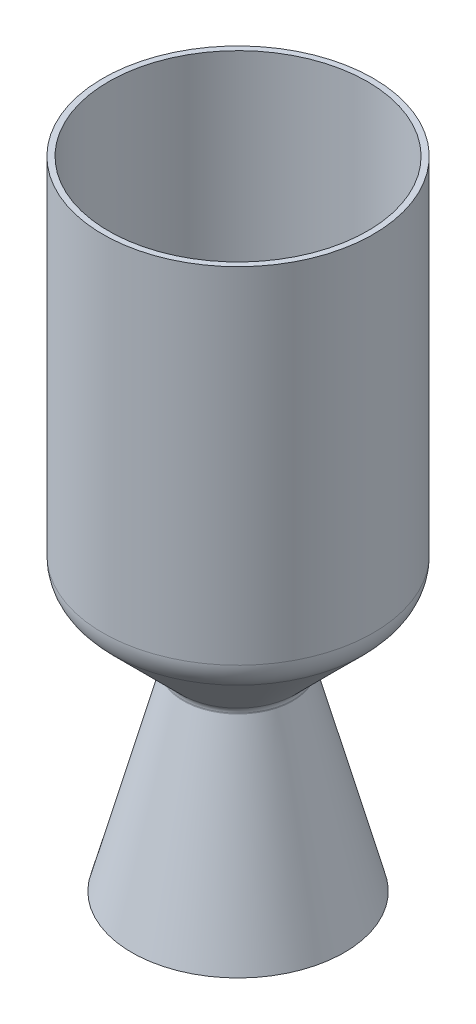
ISO-10303-21;
HEADER;
FILE_DESCRIPTION(('STEP AP214'),'2;1');
FILE_NAME('part.step','',(''),(''),'','','');
FILE_SCHEMA(('AUTOMOTIVE_DESIGN { 1 0 10303 214 1 1 1 1 }'));
ENDSEC;
DATA;
#1=APPLICATION_CONTEXT('core data for automotive mechanical design processes');
#2=APPLICATION_PROTOCOL_DEFINITION('international standard','automotive_design',2000,#1);
#3=PRODUCT_CONTEXT('',#1,'mechanical');
#4=PRODUCT('Part','Part','',(#3));
#5=PRODUCT_RELATED_PRODUCT_CATEGORY('part','',(#4));
#6=PRODUCT_DEFINITION_FORMATION('','',#4);
#7=PRODUCT_DEFINITION_CONTEXT('part definition',#1,'design');
#8=PRODUCT_DEFINITION('design','',#6,#7);
#9=PRODUCT_DEFINITION_SHAPE('','',#8);
#10=(LENGTH_UNIT() NAMED_UNIT(*) SI_UNIT(.MILLI.,.METRE.));
#11=(NAMED_UNIT(*) PLANE_ANGLE_UNIT() SI_UNIT($,.RADIAN.));
#12=(NAMED_UNIT(*) SI_UNIT($,.STERADIAN.) SOLID_ANGLE_UNIT());
#13=UNCERTAINTY_MEASURE_WITH_UNIT(LENGTH_MEASURE(1.E-05),#10,'distance_accuracy_value','');
#14=(GEOMETRIC_REPRESENTATION_CONTEXT(3) GLOBAL_UNCERTAINTY_ASSIGNED_CONTEXT((#13)) GLOBAL_UNIT_ASSIGNED_CONTEXT((#10,
#11,#12)) REPRESENTATION_CONTEXT('',''));
#15=CARTESIAN_POINT('',(0.,0.,0.));
#16=DIRECTION('',(0.,0.,1.));
#17=DIRECTION('',(1.,0.,0.));
#18=AXIS2_PLACEMENT_3D('',#15,#16,#17);
#19=CARTESIAN_POINT('',(0.,-0.328700187280291,0.));
#20=DIRECTION('',(0.,-1.,0.));
#21=DIRECTION('',(0.,0.,-1.));
#22=AXIS2_PLACEMENT_3D('',#19,#20,#21);
#23=CONICAL_SURFACE('',#22,24.1732742006129,0.261799387799116);
#24=CARTESIAN_POINT('',(0.,-85.1588771022838,0.));
#25=DIRECTION('',(0.,-1.,0.));
#26=DIRECTION('',(0.,0.,-1.));
#27=AXIS2_PLACEMENT_3D('',#24,#25,#26);
#28=CIRCLE('',#27,46.9034515987742);
#29=CARTESIAN_POINT('',(0.,-85.1588771022838,-46.9034515987742));
#30=VERTEX_POINT('',#29);
#31=EDGE_CURVE('E98',#30,#30,#28,.T.);
#32=ORIENTED_EDGE('',*,*,#31,.F.);
#33=EDGE_LOOP('',(#32));
#34=FACE_BOUND('',#33,.T.);
#35=CARTESIAN_POINT('',(0.,-0.328700187280291,0.));
#36=DIRECTION('',(0.,-1.,0.));
#37=DIRECTION('',(0.,0.,-1.));
#38=AXIS2_PLACEMENT_3D('',#35,#36,#37);
#39=CIRCLE('',#38,24.1732742006129);
#40=CARTESIAN_POINT('',(0.,-0.328700187280291,-24.1732742006129));
#41=VERTEX_POINT('',#40);
#42=EDGE_CURVE('E10',#41,#41,#39,.T.);
#43=ORIENTED_EDGE('',*,*,#42,.T.);
#44=EDGE_LOOP('',(#43));
#45=FACE_BOUND('',#44,.T.);
#46=ADVANCED_FACE('F39',(#34,#45),#23,.T.);
#47=CARTESIAN_POINT('',(0.,-1.30614446586829E-13,0.));
#48=DIRECTION('',(0.,-1.,0.));
#49=DIRECTION('',(0.,0.,-1.));
#50=AXIS2_PLACEMENT_3D('',#47,#48,#49);
#51=TOROIDAL_SURFACE('',#50,25.4,1.27);
#52=ORIENTED_EDGE('',*,*,#42,.F.);
#53=EDGE_LOOP('',(#52));
#54=FACE_BOUND('',#53,.T.);
#55=CARTESIAN_POINT('',(0.,0.,0.));
#56=DIRECTION('',(0.,-1.,0.));
#57=DIRECTION('',(0.,0.,-1.));
#58=AXIS2_PLACEMENT_3D('',#55,#56,#57);
#59=CIRCLE('',#58,24.13);
#60=CARTESIAN_POINT('',(0.,0.,-24.13));
#61=VERTEX_POINT('',#60);
#62=EDGE_CURVE('E46',#61,#61,#59,.T.);
#63=ORIENTED_EDGE('',*,*,#62,.T.);
#64=EDGE_LOOP('',(#63));
#65=FACE_BOUND('',#64,.T.);
#66=ADVANCED_FACE('F107',(#54,#65),#51,.F.);
#67=CARTESIAN_POINT('',(0.,-2.17690744311381E-13,0.));
#68=DIRECTION('',(0.,-1.,0.));
#69=DIRECTION('',(0.,0.,-1.));
#70=AXIS2_PLACEMENT_3D('',#67,#68,#69);
#71=TOROIDAL_SURFACE('',#70,27.94,3.81);
#72=ORIENTED_EDGE('',*,*,#62,.F.);
#73=EDGE_LOOP('',(#72));
#74=FACE_BOUND('',#73,.T.);
#75=CARTESIAN_POINT('',(0.,2.69407683632053,0.));
#76=DIRECTION('',(0.,-1.,0.));
#77=DIRECTION('',(0.,0.,-1.));
#78=AXIS2_PLACEMENT_3D('',#75,#76,#77);
#79=CIRCLE('',#78,25.2459231636792);
#80=CARTESIAN_POINT('',(0.,2.69407683632053,-25.2459231636792));
#81=VERTEX_POINT('',#80);
#82=EDGE_CURVE('E51',#81,#81,#79,.T.);
#83=ORIENTED_EDGE('',*,*,#82,.T.);
#84=EDGE_LOOP('',(#83));
#85=FACE_BOUND('',#84,.T.);
#86=ADVANCED_FACE('F111',(#74,#85),#71,.F.);
#87=CARTESIAN_POINT('',(0.,32.6744610179241,0.));
#88=DIRECTION('',(0.,1.,0.));
#89=DIRECTION('',(0.,0.,1.));
#90=AXIS2_PLACEMENT_3D('',#87,#88,#89);
#91=CONICAL_SURFACE('',#90,55.2263073452829,0.785398163397451);
#92=ORIENTED_EDGE('',*,*,#82,.F.);
#93=EDGE_LOOP('',(#92));
#94=FACE_BOUND('',#93,.T.);
#95=CARTESIAN_POINT('',(0.,32.6744610179241,0.));
#96=DIRECTION('',(0.,-1.,0.));
#97=DIRECTION('',(0.,0.,-1.));
#98=AXIS2_PLACEMENT_3D('',#95,#96,#97);
#99=CIRCLE('',#98,55.2263073452829);
#100=CARTESIAN_POINT('',(0.,32.6744610179241,-55.2263073452829));
#101=VERTEX_POINT('',#100);
#102=EDGE_CURVE('E56',#101,#101,#99,.T.);
#103=ORIENTED_EDGE('',*,*,#102,.T.);
#104=EDGE_LOOP('',(#103));
#105=FACE_BOUND('',#104,.T.);
#106=ADVANCED_FACE('F116',(#94,#105),#91,.T.);
#107=CARTESIAN_POINT('',(0.,43.4507683632071,0.));
#108=DIRECTION('',(0.,-1.,0.));
#109=DIRECTION('',(0.,0.,-1.));
#110=AXIS2_PLACEMENT_3D('',#107,#108,#109);
#111=TOROIDAL_SURFACE('',#110,44.45,15.24);
#112=ORIENTED_EDGE('',*,*,#102,.F.);
#113=EDGE_LOOP('',(#112));
#114=FACE_BOUND('',#113,.T.);
#115=CARTESIAN_POINT('',(0.,43.4507683632071,0.));
#116=DIRECTION('',(0.,-1.,0.));
#117=DIRECTION('',(0.,0.,-1.));
#118=AXIS2_PLACEMENT_3D('',#115,#116,#117);
#119=CIRCLE('',#118,59.69);
#120=CARTESIAN_POINT('',(0.,43.4507683632071,-59.69));
#121=VERTEX_POINT('',#120);
#122=EDGE_CURVE('E62',#121,#121,#119,.T.);
#123=ORIENTED_EDGE('',*,*,#122,.T.);
#124=EDGE_LOOP('',(#123));
#125=FACE_BOUND('',#124,.T.);
#126=ADVANCED_FACE('F122',(#114,#125),#111,.T.);
#127=CARTESIAN_POINT('',(0.,0.,0.));
#128=DIRECTION('',(0.,-1.,0.));
#129=DIRECTION('',(0.,0.,-1.));
#130=AXIS2_PLACEMENT_3D('',#127,#128,#129);
#131=CYLINDRICAL_SURFACE('',#130,59.69);
#132=ORIENTED_EDGE('',*,*,#122,.F.);
#133=EDGE_LOOP('',(#132));
#134=FACE_BOUND('',#133,.T.);
#135=CARTESIAN_POINT('',(0.,195.850768363207,0.));
#136=DIRECTION('',(0.,-1.,0.));
#137=DIRECTION('',(0.,0.,-1.));
#138=AXIS2_PLACEMENT_3D('',#135,#136,#137);
#139=CIRCLE('',#138,59.69);
#140=CARTESIAN_POINT('',(0.,195.850768363207,-59.69));
#141=VERTEX_POINT('',#140);
#142=EDGE_CURVE('E66',#141,#141,#139,.T.);
#143=ORIENTED_EDGE('',*,*,#142,.T.);
#144=EDGE_LOOP('',(#143));
#145=FACE_BOUND('',#144,.T.);
#146=ADVANCED_FACE('F126',(#134,#145),#131,.T.);
#147=CARTESIAN_POINT('',(-59.69,195.850768363207,0.));
#148=DIRECTION('',(0.,1.,0.));
#149=DIRECTION('',(0.,0.,1.));
#150=AXIS2_PLACEMENT_3D('',#147,#148,#149);
#151=PLANE('',#150);
#152=CARTESIAN_POINT('',(0.,195.850768363207,0.));
#153=DIRECTION('',(0.,-1.,0.));
#154=DIRECTION('',(0.,0.,-1.));
#155=AXIS2_PLACEMENT_3D('',#152,#153,#154);
#156=CIRCLE('',#155,57.15);
#157=CARTESIAN_POINT('',(0.,195.850768363207,-57.15));
#158=VERTEX_POINT('',#157);
#159=EDGE_CURVE('E70',#158,#158,#156,.T.);
#160=ORIENTED_EDGE('',*,*,#159,.T.);
#161=EDGE_LOOP('',(#160));
#162=FACE_BOUND('',#161,.T.);
#163=ORIENTED_EDGE('',*,*,#142,.F.);
#164=EDGE_LOOP('',(#163));
#165=FACE_BOUND('',#164,.T.);
#166=ADVANCED_FACE('F130',(#162,#165),#151,.T.);
#167=CARTESIAN_POINT('',(0.,0.,0.));
#168=DIRECTION('',(0.,-1.,0.));
#169=DIRECTION('',(0.,0.,-1.));
#170=AXIS2_PLACEMENT_3D('',#167,#168,#169);
#171=CYLINDRICAL_SURFACE('',#170,57.15);
#172=CARTESIAN_POINT('',(0.,43.4507683632071,0.));
#173=DIRECTION('',(0.,-1.,0.));
#174=DIRECTION('',(0.,0.,-1.));
#175=AXIS2_PLACEMENT_3D('',#172,#173,#174);
#176=CIRCLE('',#175,57.15);
#177=CARTESIAN_POINT('',(0.,43.4507683632071,-57.15));
#178=VERTEX_POINT('',#177);
#179=EDGE_CURVE('E74',#178,#178,#176,.T.);
#180=ORIENTED_EDGE('',*,*,#179,.T.);
#181=EDGE_LOOP('',(#180));
#182=FACE_BOUND('',#181,.T.);
#183=ORIENTED_EDGE('',*,*,#159,.F.);
#184=EDGE_LOOP('',(#183));
#185=FACE_BOUND('',#184,.T.);
#186=ADVANCED_FACE('F134',(#182,#185),#171,.F.);
#187=CARTESIAN_POINT('',(0.,43.4507683632071,0.));
#188=DIRECTION('',(0.,-1.,0.));
#189=DIRECTION('',(0.,0.,-1.));
#190=AXIS2_PLACEMENT_3D('',#187,#188,#189);
#191=TOROIDAL_SURFACE('',#190,44.45,12.7);
#192=CARTESIAN_POINT('',(0.,34.4705122421379,0.));
#193=DIRECTION('',(0.,-1.,0.));
#194=DIRECTION('',(0.,0.,-1.));
#195=AXIS2_PLACEMENT_3D('',#192,#193,#194);
#196=CIRCLE('',#195,53.4302561210691);
#197=CARTESIAN_POINT('',(0.,34.4705122421379,-53.4302561210691));
#198=VERTEX_POINT('',#197);
#199=EDGE_CURVE('E78',#198,#198,#196,.T.);
#200=ORIENTED_EDGE('',*,*,#199,.T.);
#201=EDGE_LOOP('',(#200));
#202=FACE_BOUND('',#201,.T.);
#203=ORIENTED_EDGE('',*,*,#179,.F.);
#204=EDGE_LOOP('',(#203));
#205=FACE_BOUND('',#204,.T.);
#206=ADVANCED_FACE('F138',(#202,#205),#191,.F.);
#207=CARTESIAN_POINT('',(0.,34.4705122421379,0.));
#208=DIRECTION('',(0.,1.,0.));
#209=DIRECTION('',(0.,0.,1.));
#210=AXIS2_PLACEMENT_3D('',#207,#208,#209);
#211=CONICAL_SURFACE('',#210,53.4302561210691,0.78539816339745);
#212=CARTESIAN_POINT('',(0.,4.49012806053436,0.));
#213=DIRECTION('',(0.,-1.,0.));
#214=DIRECTION('',(0.,0.,-1.));
#215=AXIS2_PLACEMENT_3D('',#212,#213,#214);
#216=CIRCLE('',#215,23.4498719394654);
#217=CARTESIAN_POINT('',(0.,4.49012806053436,-23.4498719394654));
#218=VERTEX_POINT('',#217);
#219=EDGE_CURVE('E82',#218,#218,#216,.T.);
#220=ORIENTED_EDGE('',*,*,#219,.T.);
#221=EDGE_LOOP('',(#220));
#222=FACE_BOUND('',#221,.T.);
#223=ORIENTED_EDGE('',*,*,#199,.F.);
#224=EDGE_LOOP('',(#223));
#225=FACE_BOUND('',#224,.T.);
#226=ADVANCED_FACE('F142',(#222,#225),#211,.F.);
#227=CARTESIAN_POINT('',(0.,-2.17690744311381E-13,0.));
#228=DIRECTION('',(0.,-1.,0.));
#229=DIRECTION('',(0.,0.,-1.));
#230=AXIS2_PLACEMENT_3D('',#227,#228,#229);
#231=TOROIDAL_SURFACE('',#230,27.94,6.35);
#232=CARTESIAN_POINT('',(0.,0.,0.));
#233=DIRECTION('',(0.,-1.,0.));
#234=DIRECTION('',(0.,0.,-1.));
#235=AXIS2_PLACEMENT_3D('',#232,#233,#234);
#236=CIRCLE('',#235,21.59);
#237=CARTESIAN_POINT('',(0.,0.,-21.59));
#238=VERTEX_POINT('',#237);
#239=EDGE_CURVE('E86',#238,#238,#236,.T.);
#240=ORIENTED_EDGE('',*,*,#239,.T.);
#241=EDGE_LOOP('',(#240));
#242=FACE_BOUND('',#241,.T.);
#243=ORIENTED_EDGE('',*,*,#219,.F.);
#244=EDGE_LOOP('',(#243));
#245=FACE_BOUND('',#244,.T.);
#246=ADVANCED_FACE('F146',(#242,#245),#231,.T.);
#247=CARTESIAN_POINT('',(0.,-1.30614446586829E-13,0.));
#248=DIRECTION('',(0.,-1.,0.));
#249=DIRECTION('',(0.,0.,-1.));
#250=AXIS2_PLACEMENT_3D('',#247,#248,#249);
#251=TOROIDAL_SURFACE('',#250,25.4,3.81);
#252=CARTESIAN_POINT('',(0.,-0.98610056184061,0.));
#253=DIRECTION('',(0.,-1.,0.));
#254=DIRECTION('',(0.,0.,-1.));
#255=AXIS2_PLACEMENT_3D('',#252,#253,#254);
#256=CIRCLE('',#255,21.7198226018386);
#257=CARTESIAN_POINT('',(0.,-0.98610056184061,-21.7198226018386));
#258=VERTEX_POINT('',#257);
#259=EDGE_CURVE('E90',#258,#258,#256,.T.);
#260=ORIENTED_EDGE('',*,*,#259,.T.);
#261=EDGE_LOOP('',(#260));
#262=FACE_BOUND('',#261,.T.);
#263=ORIENTED_EDGE('',*,*,#239,.F.);
#264=EDGE_LOOP('',(#263));
#265=FACE_BOUND('',#264,.T.);
#266=ADVANCED_FACE('F150',(#262,#265),#251,.T.);
#267=CARTESIAN_POINT('',(0.,-0.98610056184061,0.));
#268=DIRECTION('',(0.,-1.,0.));
#269=DIRECTION('',(0.,0.,-1.));
#270=AXIS2_PLACEMENT_3D('',#267,#268,#269);
#271=CONICAL_SURFACE('',#270,21.7198226018386,0.261799387799116);
#272=CARTESIAN_POINT('',(0.,-85.8162774768441,0.));
#273=DIRECTION('',(0.,-1.,0.));
#274=DIRECTION('',(0.,0.,-1.));
#275=AXIS2_PLACEMENT_3D('',#272,#273,#274);
#276=CIRCLE('',#275,44.45);
#277=CARTESIAN_POINT('',(0.,-85.8162774768441,-44.45));
#278=VERTEX_POINT('',#277);
#279=EDGE_CURVE('E94',#278,#278,#276,.T.);
#280=ORIENTED_EDGE('',*,*,#279,.T.);
#281=EDGE_LOOP('',(#280));
#282=FACE_BOUND('',#281,.T.);
#283=ORIENTED_EDGE('',*,*,#259,.F.);
#284=EDGE_LOOP('',(#283));
#285=FACE_BOUND('',#284,.T.);
#286=ADVANCED_FACE('F154',(#282,#285),#271,.F.);
#287=CARTESIAN_POINT('',(0.,-85.8162774768441,0.));
#288=DIRECTION('',(0.,1.,0.));
#289=DIRECTION('',(0.,0.,1.));
#290=AXIS2_PLACEMENT_3D('',#287,#288,#289);
#291=CONICAL_SURFACE('',#290,44.45,1.30899693899579);
#292=ORIENTED_EDGE('',*,*,#31,.T.);
#293=EDGE_LOOP('',(#292));
#294=FACE_BOUND('',#293,.T.);
#295=ORIENTED_EDGE('',*,*,#279,.F.);
#296=EDGE_LOOP('',(#295));
#297=FACE_BOUND('',#296,.T.);
#298=ADVANCED_FACE('F103',(#294,#297),#291,.T.);
#299=CLOSED_SHELL('',(#46,#66,#86,#106,#126,#146,#166,#186,#206,#226,#246,#266,#286,#298));
#300=MANIFOLD_SOLID_BREP('B2',#299);
#301=ADVANCED_BREP_SHAPE_REPRESENTATION('',(#18,#300),#14);
#302=SHAPE_DEFINITION_REPRESENTATION(#9,#301);
ENDSEC;
END-ISO-10303-21;
